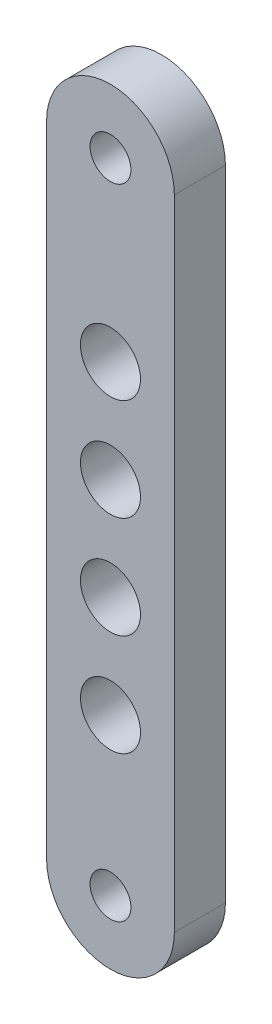
ISO-10303-21;
HEADER;
FILE_DESCRIPTION(('STEP AP214'),'2;1');
FILE_NAME('part.step','',(''),(''),'','','');
FILE_SCHEMA(('AUTOMOTIVE_DESIGN { 1 0 10303 214 1 1 1 1 }'));
ENDSEC;
DATA;
#1=APPLICATION_CONTEXT('core data for automotive mechanical design processes');
#2=APPLICATION_PROTOCOL_DEFINITION('international standard','automotive_design',2000,#1);
#3=PRODUCT_CONTEXT('',#1,'mechanical');
#4=PRODUCT('Part','Part','',(#3));
#5=PRODUCT_RELATED_PRODUCT_CATEGORY('part','',(#4));
#6=PRODUCT_DEFINITION_FORMATION('','',#4);
#7=PRODUCT_DEFINITION_CONTEXT('part definition',#1,'design');
#8=PRODUCT_DEFINITION('design','',#6,#7);
#9=PRODUCT_DEFINITION_SHAPE('','',#8);
#10=(LENGTH_UNIT() NAMED_UNIT(*) SI_UNIT(.MILLI.,.METRE.));
#11=(NAMED_UNIT(*) PLANE_ANGLE_UNIT() SI_UNIT($,.RADIAN.));
#12=(NAMED_UNIT(*) SI_UNIT($,.STERADIAN.) SOLID_ANGLE_UNIT());
#13=UNCERTAINTY_MEASURE_WITH_UNIT(LENGTH_MEASURE(1.E-05),#10,'distance_accuracy_value','');
#14=(GEOMETRIC_REPRESENTATION_CONTEXT(3) GLOBAL_UNCERTAINTY_ASSIGNED_CONTEXT((#13)) GLOBAL_UNIT_ASSIGNED_CONTEXT((#10,
#11,#12)) REPRESENTATION_CONTEXT('',''));
#15=CARTESIAN_POINT('',(0.,0.,0.));
#16=DIRECTION('',(0.,0.,1.));
#17=DIRECTION('',(1.,0.,0.));
#18=AXIS2_PLACEMENT_3D('',#15,#16,#17);
#19=CARTESIAN_POINT('',(0.,0.,4.));
#20=DIRECTION('',(0.,0.,1.));
#21=DIRECTION('',(1.,0.,0.));
#22=AXIS2_PLACEMENT_3D('',#19,#20,#21);
#23=PLANE('',#22);
#24=CARTESIAN_POINT('',(0.,20.21,4.));
#25=DIRECTION('',(0.,0.,1.));
#26=DIRECTION('',(1.,0.,0.));
#27=AXIS2_PLACEMENT_3D('',#24,#25,#26);
#28=CIRCLE('',#27,2.35);
#29=CARTESIAN_POINT('',(2.35,20.21,4.));
#30=VERTEX_POINT('',#29);
#31=EDGE_CURVE('E160',#30,#30,#28,.T.);
#32=ORIENTED_EDGE('',*,*,#31,.F.);
#33=EDGE_LOOP('',(#32));
#34=FACE_BOUND('',#33,.T.);
#35=CARTESIAN_POINT('',(0.,36.17,4.));
#36=DIRECTION('',(0.,0.,1.));
#37=DIRECTION('',(1.,0.,0.));
#38=AXIS2_PLACEMENT_3D('',#35,#36,#37);
#39=CIRCLE('',#38,2.35);
#40=CARTESIAN_POINT('',(2.35,36.17,4.));
#41=VERTEX_POINT('',#40);
#42=EDGE_CURVE('E144',#41,#41,#39,.T.);
#43=ORIENTED_EDGE('',*,*,#42,.F.);
#44=EDGE_LOOP('',(#43));
#45=FACE_BOUND('',#44,.T.);
#46=CARTESIAN_POINT('',(0.,0.,4.));
#47=DIRECTION('',(0.,0.,1.));
#48=DIRECTION('',(1.,0.,0.));
#49=AXIS2_PLACEMENT_3D('',#46,#47,#48);
#50=CIRCLE('',#49,1.60000000000001);
#51=CARTESIAN_POINT('',(1.60000000000001,0.,4.));
#52=VERTEX_POINT('',#51);
#53=EDGE_CURVE('E112',#52,#52,#50,.T.);
#54=ORIENTED_EDGE('',*,*,#53,.F.);
#55=EDGE_LOOP('',(#54));
#56=FACE_BOUND('',#55,.T.);
#57=CARTESIAN_POINT('',(0.,0.,4.));
#58=DIRECTION('',(0.,0.,1.));
#59=DIRECTION('',(1.,0.,0.));
#60=AXIS2_PLACEMENT_3D('',#57,#58,#59);
#61=CIRCLE('',#60,5.);
#62=CARTESIAN_POINT('',(-5.,0.,4.));
#63=VERTEX_POINT('',#62);
#64=CARTESIAN_POINT('',(5.,0.,4.));
#65=VERTEX_POINT('',#64);
#66=EDGE_CURVE('E91',#63,#65,#61,.T.);
#67=ORIENTED_EDGE('',*,*,#66,.T.);
#68=DIRECTION('',(0.,1.,0.));
#69=VECTOR('',#68,1.);
#70=CARTESIAN_POINT('',(5.,0.,4.));
#71=LINE('',#70,#69);
#72=CARTESIAN_POINT('',(5.,50.,4.));
#73=VERTEX_POINT('',#72);
#74=EDGE_CURVE('E86',#65,#73,#71,.T.);
#75=ORIENTED_EDGE('',*,*,#74,.T.);
#76=CARTESIAN_POINT('',(0.,50.,4.));
#77=DIRECTION('',(0.,0.,1.));
#78=DIRECTION('',(-1.,0.,0.));
#79=AXIS2_PLACEMENT_3D('',#76,#77,#78);
#80=CIRCLE('',#79,5.);
#81=CARTESIAN_POINT('',(-5.,50.,4.));
#82=VERTEX_POINT('',#81);
#83=EDGE_CURVE('E89',#73,#82,#80,.T.);
#84=ORIENTED_EDGE('',*,*,#83,.T.);
#85=DIRECTION('',(0.,-1.,0.));
#86=VECTOR('',#85,1.);
#87=CARTESIAN_POINT('',(-5.,0.,4.));
#88=LINE('',#87,#86);
#89=EDGE_CURVE('E56',#82,#63,#88,.T.);
#90=ORIENTED_EDGE('',*,*,#89,.T.);
#91=EDGE_LOOP('',(#67,#75,#84,#90));
#92=FACE_BOUND('',#91,.T.);
#93=CARTESIAN_POINT('',(0.,50.,4.));
#94=DIRECTION('',(0.,0.,1.));
#95=DIRECTION('',(1.,0.,0.));
#96=AXIS2_PLACEMENT_3D('',#93,#94,#95);
#97=CIRCLE('',#96,1.6);
#98=CARTESIAN_POINT('',(1.6,50.,4.));
#99=VERTEX_POINT('',#98);
#100=EDGE_CURVE('E136',#99,#99,#97,.T.);
#101=ORIENTED_EDGE('',*,*,#100,.F.);
#102=EDGE_LOOP('',(#101));
#103=FACE_BOUND('',#102,.T.);
#104=CARTESIAN_POINT('',(0.,28.19,4.));
#105=DIRECTION('',(0.,0.,1.));
#106=DIRECTION('',(1.,0.,0.));
#107=AXIS2_PLACEMENT_3D('',#104,#105,#106);
#108=CIRCLE('',#107,2.35);
#109=CARTESIAN_POINT('',(2.35,28.19,4.));
#110=VERTEX_POINT('',#109);
#111=EDGE_CURVE('E152',#110,#110,#108,.T.);
#112=ORIENTED_EDGE('',*,*,#111,.F.);
#113=EDGE_LOOP('',(#112));
#114=FACE_BOUND('',#113,.T.);
#115=CARTESIAN_POINT('',(0.,12.23,4.));
#116=DIRECTION('',(0.,0.,1.));
#117=DIRECTION('',(1.,0.,0.));
#118=AXIS2_PLACEMENT_3D('',#115,#116,#117);
#119=CIRCLE('',#118,2.35);
#120=CARTESIAN_POINT('',(2.35,12.23,4.));
#121=VERTEX_POINT('',#120);
#122=EDGE_CURVE('E168',#121,#121,#119,.T.);
#123=ORIENTED_EDGE('',*,*,#122,.F.);
#124=EDGE_LOOP('',(#123));
#125=FACE_BOUND('',#124,.T.);
#126=ADVANCED_FACE('F38',(#34,#45,#56,#92,#103,#114,#125),#23,.T.);
#127=CARTESIAN_POINT('',(0.,0.,0.));
#128=DIRECTION('',(0.,0.,1.));
#129=DIRECTION('',(1.,0.,0.));
#130=AXIS2_PLACEMENT_3D('',#127,#128,#129);
#131=PLANE('',#130);
#132=CARTESIAN_POINT('',(0.,0.,0.));
#133=DIRECTION('',(0.,0.,1.));
#134=DIRECTION('',(1.,0.,0.));
#135=AXIS2_PLACEMENT_3D('',#132,#133,#134);
#136=CIRCLE('',#135,5.);
#137=CARTESIAN_POINT('',(-5.,0.,0.));
#138=VERTEX_POINT('',#137);
#139=CARTESIAN_POINT('',(5.,0.,0.));
#140=VERTEX_POINT('',#139);
#141=EDGE_CURVE('E108',#138,#140,#136,.T.);
#142=ORIENTED_EDGE('',*,*,#141,.F.);
#143=DIRECTION('',(0.,-1.,0.));
#144=VECTOR('',#143,1.);
#145=CARTESIAN_POINT('',(-5.,0.,0.));
#146=LINE('',#145,#144);
#147=CARTESIAN_POINT('',(-5.,50.,0.));
#148=VERTEX_POINT('',#147);
#149=EDGE_CURVE('E79',#148,#138,#146,.T.);
#150=ORIENTED_EDGE('',*,*,#149,.F.);
#151=CARTESIAN_POINT('',(0.,50.,0.));
#152=DIRECTION('',(0.,0.,1.));
#153=DIRECTION('',(-1.,0.,0.));
#154=AXIS2_PLACEMENT_3D('',#151,#152,#153);
#155=CIRCLE('',#154,5.);
#156=CARTESIAN_POINT('',(5.,50.,0.));
#157=VERTEX_POINT('',#156);
#158=EDGE_CURVE('E73',#157,#148,#155,.T.);
#159=ORIENTED_EDGE('',*,*,#158,.F.);
#160=DIRECTION('',(0.,1.,0.));
#161=VECTOR('',#160,1.);
#162=CARTESIAN_POINT('',(5.,0.,0.));
#163=LINE('',#162,#161);
#164=EDGE_CURVE('E96',#140,#157,#163,.T.);
#165=ORIENTED_EDGE('',*,*,#164,.F.);
#166=EDGE_LOOP('',(#142,#150,#159,#165));
#167=FACE_BOUND('',#166,.T.);
#168=CARTESIAN_POINT('',(0.,0.,0.));
#169=DIRECTION('',(0.,0.,1.));
#170=DIRECTION('',(1.,0.,0.));
#171=AXIS2_PLACEMENT_3D('',#168,#169,#170);
#172=CIRCLE('',#171,1.60000000000001);
#173=CARTESIAN_POINT('',(1.60000000000001,0.,0.));
#174=VERTEX_POINT('',#173);
#175=EDGE_CURVE('E132',#174,#174,#172,.T.);
#176=ORIENTED_EDGE('',*,*,#175,.T.);
#177=EDGE_LOOP('',(#176));
#178=FACE_BOUND('',#177,.T.);
#179=CARTESIAN_POINT('',(0.,50.,0.));
#180=DIRECTION('',(0.,0.,1.));
#181=DIRECTION('',(1.,0.,0.));
#182=AXIS2_PLACEMENT_3D('',#179,#180,#181);
#183=CIRCLE('',#182,1.6);
#184=CARTESIAN_POINT('',(1.6,50.,0.));
#185=VERTEX_POINT('',#184);
#186=EDGE_CURVE('E140',#185,#185,#183,.T.);
#187=ORIENTED_EDGE('',*,*,#186,.T.);
#188=EDGE_LOOP('',(#187));
#189=FACE_BOUND('',#188,.T.);
#190=CARTESIAN_POINT('',(0.,36.17,0.));
#191=DIRECTION('',(0.,0.,1.));
#192=DIRECTION('',(1.,0.,0.));
#193=AXIS2_PLACEMENT_3D('',#190,#191,#192);
#194=CIRCLE('',#193,2.35);
#195=CARTESIAN_POINT('',(2.35,36.17,0.));
#196=VERTEX_POINT('',#195);
#197=EDGE_CURVE('E148',#196,#196,#194,.T.);
#198=ORIENTED_EDGE('',*,*,#197,.T.);
#199=EDGE_LOOP('',(#198));
#200=FACE_BOUND('',#199,.T.);
#201=CARTESIAN_POINT('',(0.,28.19,0.));
#202=DIRECTION('',(0.,0.,1.));
#203=DIRECTION('',(1.,0.,0.));
#204=AXIS2_PLACEMENT_3D('',#201,#202,#203);
#205=CIRCLE('',#204,2.35);
#206=CARTESIAN_POINT('',(2.35,28.19,0.));
#207=VERTEX_POINT('',#206);
#208=EDGE_CURVE('E156',#207,#207,#205,.T.);
#209=ORIENTED_EDGE('',*,*,#208,.T.);
#210=EDGE_LOOP('',(#209));
#211=FACE_BOUND('',#210,.T.);
#212=CARTESIAN_POINT('',(0.,20.21,0.));
#213=DIRECTION('',(0.,0.,1.));
#214=DIRECTION('',(1.,0.,0.));
#215=AXIS2_PLACEMENT_3D('',#212,#213,#214);
#216=CIRCLE('',#215,2.35);
#217=CARTESIAN_POINT('',(2.35,20.21,0.));
#218=VERTEX_POINT('',#217);
#219=EDGE_CURVE('E164',#218,#218,#216,.T.);
#220=ORIENTED_EDGE('',*,*,#219,.T.);
#221=EDGE_LOOP('',(#220));
#222=FACE_BOUND('',#221,.T.);
#223=CARTESIAN_POINT('',(0.,12.23,0.));
#224=DIRECTION('',(0.,0.,1.));
#225=DIRECTION('',(1.,0.,0.));
#226=AXIS2_PLACEMENT_3D('',#223,#224,#225);
#227=CIRCLE('',#226,2.35);
#228=CARTESIAN_POINT('',(2.35,12.23,0.));
#229=VERTEX_POINT('',#228);
#230=EDGE_CURVE('E172',#229,#229,#227,.T.);
#231=ORIENTED_EDGE('',*,*,#230,.T.);
#232=EDGE_LOOP('',(#231));
#233=FACE_BOUND('',#232,.T.);
#234=ADVANCED_FACE('F126',(#167,#178,#189,#200,#211,#222,#233),#131,.F.);
#235=CARTESIAN_POINT('',(0.,0.,4.));
#236=DIRECTION('',(0.,0.,-1.));
#237=DIRECTION('',(-1.,0.,0.));
#238=AXIS2_PLACEMENT_3D('',#235,#236,#237);
#239=CYLINDRICAL_SURFACE('',#238,5.);
#240=ORIENTED_EDGE('',*,*,#141,.T.);
#241=DIRECTION('',(0.,0.,-1.));
#242=VECTOR('',#241,1.);
#243=CARTESIAN_POINT('',(5.,0.,4.));
#244=LINE('',#243,#242);
#245=EDGE_CURVE('E11',#65,#140,#244,.T.);
#246=ORIENTED_EDGE('',*,*,#245,.F.);
#247=ORIENTED_EDGE('',*,*,#66,.F.);
#248=DIRECTION('',(0.,0.,-1.));
#249=VECTOR('',#248,1.);
#250=CARTESIAN_POINT('',(-5.,0.,4.));
#251=LINE('',#250,#249);
#252=EDGE_CURVE('E104',#63,#138,#251,.T.);
#253=ORIENTED_EDGE('',*,*,#252,.T.);
#254=EDGE_LOOP('',(#240,#246,#247,#253));
#255=FACE_BOUND('',#254,.T.);
#256=ADVANCED_FACE('F40',(#255),#239,.T.);
#257=CARTESIAN_POINT('',(5.,0.,4.));
#258=DIRECTION('',(-1.,0.,0.));
#259=DIRECTION('',(0.,0.,1.));
#260=AXIS2_PLACEMENT_3D('',#257,#258,#259);
#261=PLANE('',#260);
#262=ORIENTED_EDGE('',*,*,#164,.T.);
#263=DIRECTION('',(0.,0.,-1.));
#264=VECTOR('',#263,1.);
#265=CARTESIAN_POINT('',(5.,50.,4.));
#266=LINE('',#265,#264);
#267=EDGE_CURVE('E48',#73,#157,#266,.T.);
#268=ORIENTED_EDGE('',*,*,#267,.F.);
#269=ORIENTED_EDGE('',*,*,#74,.F.);
#270=ORIENTED_EDGE('',*,*,#245,.T.);
#271=EDGE_LOOP('',(#262,#268,#269,#270));
#272=FACE_BOUND('',#271,.T.);
#273=ADVANCED_FACE('F95',(#272),#261,.F.);
#274=CARTESIAN_POINT('',(0.,50.,4.));
#275=DIRECTION('',(0.,0.,-1.));
#276=DIRECTION('',(-1.,0.,0.));
#277=AXIS2_PLACEMENT_3D('',#274,#275,#276);
#278=CYLINDRICAL_SURFACE('',#277,5.);
#279=ORIENTED_EDGE('',*,*,#158,.T.);
#280=DIRECTION('',(0.,0.,-1.));
#281=VECTOR('',#280,1.);
#282=CARTESIAN_POINT('',(-5.,50.,4.));
#283=LINE('',#282,#281);
#284=EDGE_CURVE('E98',#82,#148,#283,.T.);
#285=ORIENTED_EDGE('',*,*,#284,.F.);
#286=ORIENTED_EDGE('',*,*,#83,.F.);
#287=ORIENTED_EDGE('',*,*,#267,.T.);
#288=EDGE_LOOP('',(#279,#285,#286,#287));
#289=FACE_BOUND('',#288,.T.);
#290=ADVANCED_FACE('F99',(#289),#278,.T.);
#291=CARTESIAN_POINT('',(-5.,0.,4.));
#292=DIRECTION('',(1.,0.,0.));
#293=DIRECTION('',(0.,0.,-1.));
#294=AXIS2_PLACEMENT_3D('',#291,#292,#293);
#295=PLANE('',#294);
#296=ORIENTED_EDGE('',*,*,#149,.T.);
#297=ORIENTED_EDGE('',*,*,#252,.F.);
#298=ORIENTED_EDGE('',*,*,#89,.F.);
#299=ORIENTED_EDGE('',*,*,#284,.T.);
#300=EDGE_LOOP('',(#296,#297,#298,#299));
#301=FACE_BOUND('',#300,.T.);
#302=ADVANCED_FACE('F123',(#301),#295,.F.);
#303=CARTESIAN_POINT('',(0.,0.,4.));
#304=DIRECTION('',(0.,0.,-1.));
#305=DIRECTION('',(-1.,0.,0.));
#306=AXIS2_PLACEMENT_3D('',#303,#304,#305);
#307=CYLINDRICAL_SURFACE('',#306,1.60000000000001);
#308=ORIENTED_EDGE('',*,*,#53,.T.);
#309=EDGE_LOOP('',(#308));
#310=FACE_BOUND('',#309,.T.);
#311=ORIENTED_EDGE('',*,*,#175,.F.);
#312=EDGE_LOOP('',(#311));
#313=FACE_BOUND('',#312,.T.);
#314=ADVANCED_FACE('F194',(#310,#313),#307,.F.);
#315=CARTESIAN_POINT('',(0.,50.,4.));
#316=DIRECTION('',(0.,0.,-1.));
#317=DIRECTION('',(-1.,0.,0.));
#318=AXIS2_PLACEMENT_3D('',#315,#316,#317);
#319=CYLINDRICAL_SURFACE('',#318,1.6);
#320=ORIENTED_EDGE('',*,*,#100,.T.);
#321=EDGE_LOOP('',(#320));
#322=FACE_BOUND('',#321,.T.);
#323=ORIENTED_EDGE('',*,*,#186,.F.);
#324=EDGE_LOOP('',(#323));
#325=FACE_BOUND('',#324,.T.);
#326=ADVANCED_FACE('F249',(#322,#325),#319,.F.);
#327=CARTESIAN_POINT('',(0.,36.17,4.));
#328=DIRECTION('',(0.,0.,-1.));
#329=DIRECTION('',(-1.,0.,0.));
#330=AXIS2_PLACEMENT_3D('',#327,#328,#329);
#331=CYLINDRICAL_SURFACE('',#330,2.35);
#332=ORIENTED_EDGE('',*,*,#42,.T.);
#333=EDGE_LOOP('',(#332));
#334=FACE_BOUND('',#333,.T.);
#335=ORIENTED_EDGE('',*,*,#197,.F.);
#336=EDGE_LOOP('',(#335));
#337=FACE_BOUND('',#336,.T.);
#338=ADVANCED_FACE('F258',(#334,#337),#331,.F.);
#339=CARTESIAN_POINT('',(0.,28.19,4.));
#340=DIRECTION('',(0.,0.,-1.));
#341=DIRECTION('',(-1.,0.,0.));
#342=AXIS2_PLACEMENT_3D('',#339,#340,#341);
#343=CYLINDRICAL_SURFACE('',#342,2.35);
#344=ORIENTED_EDGE('',*,*,#111,.T.);
#345=EDGE_LOOP('',(#344));
#346=FACE_BOUND('',#345,.T.);
#347=ORIENTED_EDGE('',*,*,#208,.F.);
#348=EDGE_LOOP('',(#347));
#349=FACE_BOUND('',#348,.T.);
#350=ADVANCED_FACE('F267',(#346,#349),#343,.F.);
#351=CARTESIAN_POINT('',(0.,20.21,4.));
#352=DIRECTION('',(0.,0.,-1.));
#353=DIRECTION('',(-1.,0.,0.));
#354=AXIS2_PLACEMENT_3D('',#351,#352,#353);
#355=CYLINDRICAL_SURFACE('',#354,2.35);
#356=ORIENTED_EDGE('',*,*,#31,.T.);
#357=EDGE_LOOP('',(#356));
#358=FACE_BOUND('',#357,.T.);
#359=ORIENTED_EDGE('',*,*,#219,.F.);
#360=EDGE_LOOP('',(#359));
#361=FACE_BOUND('',#360,.T.);
#362=ADVANCED_FACE('F277',(#358,#361),#355,.F.);
#363=CARTESIAN_POINT('',(0.,12.23,4.));
#364=DIRECTION('',(0.,0.,-1.));
#365=DIRECTION('',(-1.,0.,0.));
#366=AXIS2_PLACEMENT_3D('',#363,#364,#365);
#367=CYLINDRICAL_SURFACE('',#366,2.35);
#368=ORIENTED_EDGE('',*,*,#122,.T.);
#369=EDGE_LOOP('',(#368));
#370=FACE_BOUND('',#369,.T.);
#371=ORIENTED_EDGE('',*,*,#230,.F.);
#372=EDGE_LOOP('',(#371));
#373=FACE_BOUND('',#372,.T.);
#374=ADVANCED_FACE('F181',(#370,#373),#367,.F.);
#375=CLOSED_SHELL('',(#126,#234,#256,#273,#290,#302,#314,#326,#338,#350,#362,#374));
#376=MANIFOLD_SOLID_BREP('B2',#375);
#377=ADVANCED_BREP_SHAPE_REPRESENTATION('',(#18,#376),#14);
#378=SHAPE_DEFINITION_REPRESENTATION(#9,#377);
ENDSEC;
END-ISO-10303-21;
